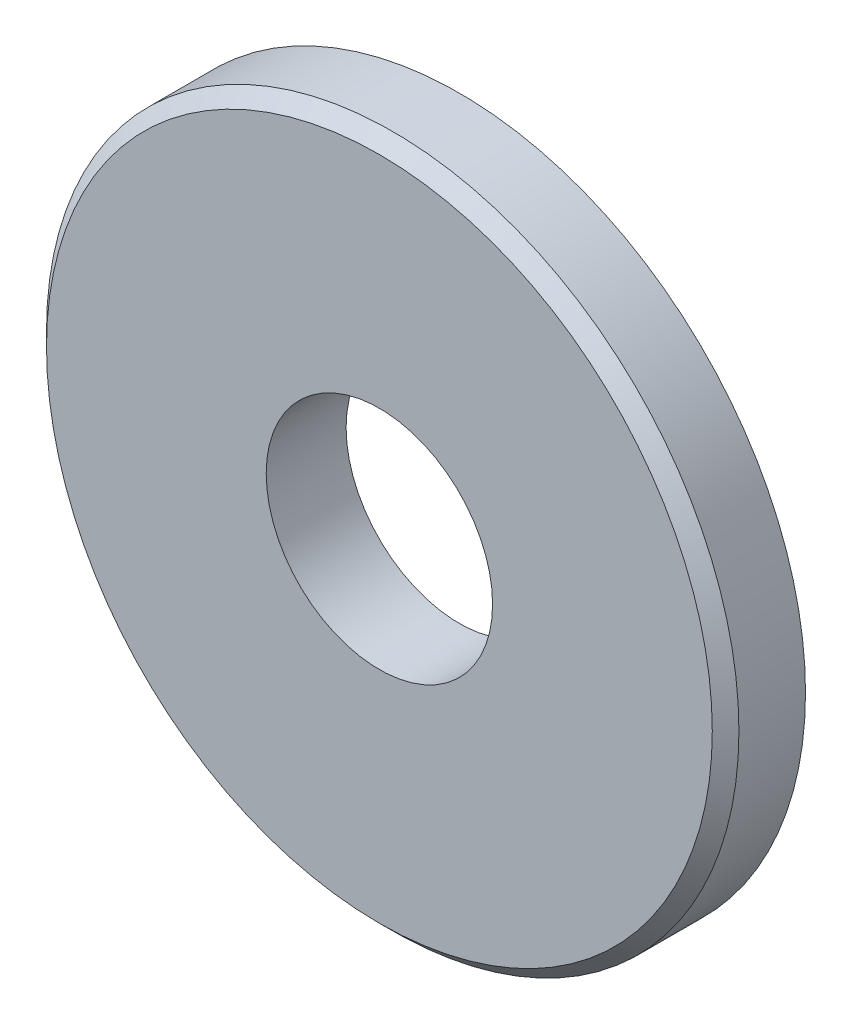
ISO-10303-21;
HEADER;
FILE_DESCRIPTION(('STEP AP214'),'2;1');
FILE_NAME('part.step','',(''),(''),'','','');
FILE_SCHEMA(('AUTOMOTIVE_DESIGN { 1 0 10303 214 1 1 1 1 }'));
ENDSEC;
DATA;
#1=APPLICATION_CONTEXT('core data for automotive mechanical design processes');
#2=APPLICATION_PROTOCOL_DEFINITION('international standard','automotive_design',2000,#1);
#3=PRODUCT_CONTEXT('',#1,'mechanical');
#4=PRODUCT('Part','Part','',(#3));
#5=PRODUCT_RELATED_PRODUCT_CATEGORY('part','',(#4));
#6=PRODUCT_DEFINITION_FORMATION('','',#4);
#7=PRODUCT_DEFINITION_CONTEXT('part definition',#1,'design');
#8=PRODUCT_DEFINITION('design','',#6,#7);
#9=PRODUCT_DEFINITION_SHAPE('','',#8);
#10=(LENGTH_UNIT() NAMED_UNIT(*) SI_UNIT(.MILLI.,.METRE.));
#11=(NAMED_UNIT(*) PLANE_ANGLE_UNIT() SI_UNIT($,.RADIAN.));
#12=(NAMED_UNIT(*) SI_UNIT($,.STERADIAN.) SOLID_ANGLE_UNIT());
#13=UNCERTAINTY_MEASURE_WITH_UNIT(LENGTH_MEASURE(1.E-05),#10,'distance_accuracy_value','');
#14=(GEOMETRIC_REPRESENTATION_CONTEXT(3) GLOBAL_UNCERTAINTY_ASSIGNED_CONTEXT((#13)) GLOBAL_UNIT_ASSIGNED_CONTEXT((#10,
#11,#12)) REPRESENTATION_CONTEXT('',''));
#15=CARTESIAN_POINT('',(0.,0.,0.));
#16=DIRECTION('',(0.,0.,1.));
#17=DIRECTION('',(1.,0.,0.));
#18=AXIS2_PLACEMENT_3D('',#15,#16,#17);
#19=CARTESIAN_POINT('',(0.,0.,3.));
#20=DIRECTION('',(0.,0.,1.));
#21=DIRECTION('',(1.,0.,0.));
#22=AXIS2_PLACEMENT_3D('',#19,#20,#21);
#23=PLANE('',#22);
#24=CARTESIAN_POINT('',(0.,0.,3.));
#25=DIRECTION('',(0.,0.,1.));
#26=DIRECTION('',(1.,0.,0.));
#27=AXIS2_PLACEMENT_3D('',#24,#25,#26);
#28=CIRCLE('',#27,12.5);
#29=CARTESIAN_POINT('',(12.5,0.,3.));
#30=VERTEX_POINT('',#29);
#31=EDGE_CURVE('E37',#30,#30,#28,.T.);
#32=ORIENTED_EDGE('',*,*,#31,.T.);
#33=EDGE_LOOP('',(#32));
#34=FACE_BOUND('',#33,.T.);
#35=CARTESIAN_POINT('',(0.,0.,3.));
#36=DIRECTION('',(0.,0.,1.));
#37=DIRECTION('',(1.,0.,0.));
#38=AXIS2_PLACEMENT_3D('',#35,#36,#37);
#39=CIRCLE('',#38,4.25);
#40=CARTESIAN_POINT('',(4.25,0.,3.));
#41=VERTEX_POINT('',#40);
#42=EDGE_CURVE('E45',#41,#41,#39,.T.);
#43=ORIENTED_EDGE('',*,*,#42,.F.);
#44=EDGE_LOOP('',(#43));
#45=FACE_BOUND('',#44,.T.);
#46=ADVANCED_FACE('F30',(#34,#45),#23,.T.);
#47=CARTESIAN_POINT('',(0.,0.,0.));
#48=DIRECTION('',(0.,0.,1.));
#49=DIRECTION('',(1.,0.,0.));
#50=AXIS2_PLACEMENT_3D('',#47,#48,#49);
#51=PLANE('',#50);
#52=CARTESIAN_POINT('',(0.,0.,0.));
#53=DIRECTION('',(0.,0.,1.));
#54=DIRECTION('',(1.,0.,0.));
#55=AXIS2_PLACEMENT_3D('',#52,#53,#54);
#56=CIRCLE('',#55,13.);
#57=CARTESIAN_POINT('',(13.,0.,0.));
#58=VERTEX_POINT('',#57);
#59=EDGE_CURVE('E41',#58,#58,#56,.T.);
#60=ORIENTED_EDGE('',*,*,#59,.F.);
#61=EDGE_LOOP('',(#60));
#62=FACE_BOUND('',#61,.T.);
#63=CARTESIAN_POINT('',(0.,0.,0.));
#64=DIRECTION('',(0.,0.,1.));
#65=DIRECTION('',(1.,0.,0.));
#66=AXIS2_PLACEMENT_3D('',#63,#64,#65);
#67=CIRCLE('',#66,4.25);
#68=CARTESIAN_POINT('',(4.25,0.,0.));
#69=VERTEX_POINT('',#68);
#70=EDGE_CURVE('E48',#69,#69,#67,.T.);
#71=ORIENTED_EDGE('',*,*,#70,.T.);
#72=EDGE_LOOP('',(#71));
#73=FACE_BOUND('',#72,.T.);
#74=ADVANCED_FACE('F58',(#62,#73),#51,.F.);
#75=CARTESIAN_POINT('',(0.,0.,3.));
#76=DIRECTION('',(0.,0.,-1.));
#77=DIRECTION('',(-1.,0.,0.));
#78=AXIS2_PLACEMENT_3D('',#75,#76,#77);
#79=CYLINDRICAL_SURFACE('',#78,13.);
#80=CARTESIAN_POINT('',(0.,0.,2.5));
#81=DIRECTION('',(0.,0.,1.));
#82=DIRECTION('',(1.,0.,0.));
#83=AXIS2_PLACEMENT_3D('',#80,#81,#82);
#84=CIRCLE('',#83,13.);
#85=CARTESIAN_POINT('',(13.,0.,2.5));
#86=VERTEX_POINT('',#85);
#87=EDGE_CURVE('E10',#86,#86,#84,.F.);
#88=ORIENTED_EDGE('',*,*,#87,.T.);
#89=EDGE_LOOP('',(#88));
#90=FACE_BOUND('',#89,.T.);
#91=ORIENTED_EDGE('',*,*,#59,.T.);
#92=EDGE_LOOP('',(#91));
#93=FACE_BOUND('',#92,.T.);
#94=ADVANCED_FACE('F63',(#90,#93),#79,.T.);
#95=CARTESIAN_POINT('',(0.,0.,3.));
#96=DIRECTION('',(0.,0.,-1.));
#97=DIRECTION('',(-1.,0.,0.));
#98=AXIS2_PLACEMENT_3D('',#95,#96,#97);
#99=CYLINDRICAL_SURFACE('',#98,4.25);
#100=ORIENTED_EDGE('',*,*,#42,.T.);
#101=EDGE_LOOP('',(#100));
#102=FACE_BOUND('',#101,.T.);
#103=ORIENTED_EDGE('',*,*,#70,.F.);
#104=EDGE_LOOP('',(#103));
#105=FACE_BOUND('',#104,.T.);
#106=ADVANCED_FACE('F54',(#102,#105),#99,.F.);
#107=CARTESIAN_POINT('',(0.,0.,3.));
#108=DIRECTION('',(0.,0.,-1.));
#109=DIRECTION('',(-1.,0.,0.));
#110=AXIS2_PLACEMENT_3D('',#107,#108,#109);
#111=CONICAL_SURFACE('',#110,12.5,0.785398163397441);
#112=ORIENTED_EDGE('',*,*,#87,.F.);
#113=EDGE_LOOP('',(#112));
#114=FACE_BOUND('',#113,.T.);
#115=ORIENTED_EDGE('',*,*,#31,.F.);
#116=EDGE_LOOP('',(#115));
#117=FACE_BOUND('',#116,.T.);
#118=ADVANCED_FACE('F32',(#114,#117),#111,.T.);
#119=CLOSED_SHELL('',(#46,#74,#94,#106,#118));
#120=MANIFOLD_SOLID_BREP('B2',#119);
#121=ADVANCED_BREP_SHAPE_REPRESENTATION('',(#18,#120),#14);
#122=SHAPE_DEFINITION_REPRESENTATION(#9,#121);
ENDSEC;
END-ISO-10303-21;
